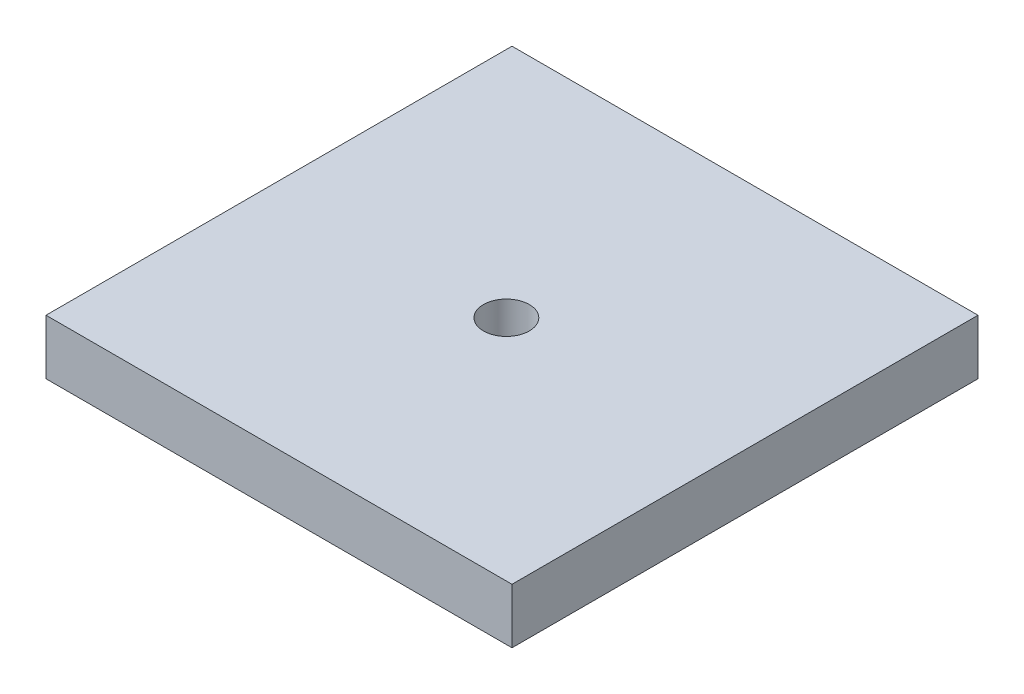
ISO-10303-21;
HEADER;
FILE_DESCRIPTION(('STEP AP214'),'2;1');
FILE_NAME('part.step','',(''),(''),'','','');
FILE_SCHEMA(('AUTOMOTIVE_DESIGN { 1 0 10303 214 1 1 1 1 }'));
ENDSEC;
DATA;
#1=APPLICATION_CONTEXT('core data for automotive mechanical design processes');
#2=APPLICATION_PROTOCOL_DEFINITION('international standard','automotive_design',2000,#1);
#3=PRODUCT_CONTEXT('',#1,'mechanical');
#4=PRODUCT('Part','Part','',(#3));
#5=PRODUCT_RELATED_PRODUCT_CATEGORY('part','',(#4));
#6=PRODUCT_DEFINITION_FORMATION('','',#4);
#7=PRODUCT_DEFINITION_CONTEXT('part definition',#1,'design');
#8=PRODUCT_DEFINITION('design','',#6,#7);
#9=PRODUCT_DEFINITION_SHAPE('','',#8);
#10=(LENGTH_UNIT() NAMED_UNIT(*) SI_UNIT(.MILLI.,.METRE.));
#11=(NAMED_UNIT(*) PLANE_ANGLE_UNIT() SI_UNIT($,.RADIAN.));
#12=(NAMED_UNIT(*) SI_UNIT($,.STERADIAN.) SOLID_ANGLE_UNIT());
#13=UNCERTAINTY_MEASURE_WITH_UNIT(LENGTH_MEASURE(1.E-05),#10,'distance_accuracy_value','');
#14=(GEOMETRIC_REPRESENTATION_CONTEXT(3) GLOBAL_UNCERTAINTY_ASSIGNED_CONTEXT((#13)) GLOBAL_UNIT_ASSIGNED_CONTEXT((#10,
#11,#12)) REPRESENTATION_CONTEXT('',''));
#15=CARTESIAN_POINT('',(0.,0.,0.));
#16=DIRECTION('',(0.,0.,1.));
#17=DIRECTION('',(1.,0.,0.));
#18=AXIS2_PLACEMENT_3D('',#15,#16,#17);
#19=CARTESIAN_POINT('',(12.7,3.,-12.7));
#20=DIRECTION('',(-1.,0.,0.));
#21=DIRECTION('',(0.,0.,1.));
#22=AXIS2_PLACEMENT_3D('',#19,#20,#21);
#23=PLANE('',#22);
#24=DIRECTION('',(0.,0.,-1.));
#25=VECTOR('',#24,1.);
#26=CARTESIAN_POINT('',(12.7,0.,-12.7));
#27=LINE('',#26,#25);
#28=CARTESIAN_POINT('',(12.7,0.,12.7));
#29=VERTEX_POINT('',#28);
#30=CARTESIAN_POINT('',(12.7,0.,-12.7));
#31=VERTEX_POINT('',#30);
#32=EDGE_CURVE('E97',#29,#31,#27,.T.);
#33=ORIENTED_EDGE('',*,*,#32,.T.);
#34=DIRECTION('',(0.,-1.,0.));
#35=VECTOR('',#34,1.);
#36=CARTESIAN_POINT('',(12.7,3.,-12.7));
#37=LINE('',#36,#35);
#38=CARTESIAN_POINT('',(12.7,3.,-12.7));
#39=VERTEX_POINT('',#38);
#40=EDGE_CURVE('E11',#39,#31,#37,.T.);
#41=ORIENTED_EDGE('',*,*,#40,.F.);
#42=DIRECTION('',(0.,0.,-1.));
#43=VECTOR('',#42,1.);
#44=CARTESIAN_POINT('',(12.7,3.,-12.7));
#45=LINE('',#44,#43);
#46=CARTESIAN_POINT('',(12.7,3.,12.7));
#47=VERTEX_POINT('',#46);
#48=EDGE_CURVE('E85',#47,#39,#45,.T.);
#49=ORIENTED_EDGE('',*,*,#48,.F.);
#50=DIRECTION('',(0.,-1.,0.));
#51=VECTOR('',#50,1.);
#52=CARTESIAN_POINT('',(12.7,3.,12.7));
#53=LINE('',#52,#51);
#54=EDGE_CURVE('E93',#47,#29,#53,.T.);
#55=ORIENTED_EDGE('',*,*,#54,.T.);
#56=EDGE_LOOP('',(#33,#41,#49,#55));
#57=FACE_BOUND('',#56,.T.);
#58=ADVANCED_FACE('F34',(#57),#23,.F.);
#59=CARTESIAN_POINT('',(-12.7,3.,-12.7));
#60=DIRECTION('',(0.,0.,1.));
#61=DIRECTION('',(1.,0.,0.));
#62=AXIS2_PLACEMENT_3D('',#59,#60,#61);
#63=PLANE('',#62);
#64=DIRECTION('',(-1.,0.,0.));
#65=VECTOR('',#64,1.);
#66=CARTESIAN_POINT('',(-12.7,0.,-12.7));
#67=LINE('',#66,#65);
#68=CARTESIAN_POINT('',(-12.7,0.,-12.7));
#69=VERTEX_POINT('',#68);
#70=EDGE_CURVE('E89',#31,#69,#67,.T.);
#71=ORIENTED_EDGE('',*,*,#70,.T.);
#72=DIRECTION('',(0.,-1.,0.));
#73=VECTOR('',#72,1.);
#74=CARTESIAN_POINT('',(-12.7,3.,-12.7));
#75=LINE('',#74,#73);
#76=CARTESIAN_POINT('',(-12.7,3.,-12.7));
#77=VERTEX_POINT('',#76);
#78=EDGE_CURVE('E42',#77,#69,#75,.T.);
#79=ORIENTED_EDGE('',*,*,#78,.F.);
#80=DIRECTION('',(-1.,0.,0.));
#81=VECTOR('',#80,1.);
#82=CARTESIAN_POINT('',(-12.7,3.,-12.7));
#83=LINE('',#82,#81);
#84=EDGE_CURVE('E80',#39,#77,#83,.T.);
#85=ORIENTED_EDGE('',*,*,#84,.F.);
#86=ORIENTED_EDGE('',*,*,#40,.T.);
#87=EDGE_LOOP('',(#71,#79,#85,#86));
#88=FACE_BOUND('',#87,.T.);
#89=ADVANCED_FACE('F88',(#88),#63,.F.);
#90=CARTESIAN_POINT('',(-12.7,3.,-12.7));
#91=DIRECTION('',(1.,0.,0.));
#92=DIRECTION('',(0.,0.,-1.));
#93=AXIS2_PLACEMENT_3D('',#90,#91,#92);
#94=PLANE('',#93);
#95=DIRECTION('',(0.,0.,1.));
#96=VECTOR('',#95,1.);
#97=CARTESIAN_POINT('',(-12.7,0.,-12.7));
#98=LINE('',#97,#96);
#99=CARTESIAN_POINT('',(-12.7,0.,12.7));
#100=VERTEX_POINT('',#99);
#101=EDGE_CURVE('E67',#69,#100,#98,.T.);
#102=ORIENTED_EDGE('',*,*,#101,.T.);
#103=DIRECTION('',(0.,-1.,0.));
#104=VECTOR('',#103,1.);
#105=CARTESIAN_POINT('',(-12.7,3.,12.7));
#106=LINE('',#105,#104);
#107=CARTESIAN_POINT('',(-12.7,3.,12.7));
#108=VERTEX_POINT('',#107);
#109=EDGE_CURVE('E90',#108,#100,#106,.T.);
#110=ORIENTED_EDGE('',*,*,#109,.F.);
#111=DIRECTION('',(0.,0.,1.));
#112=VECTOR('',#111,1.);
#113=CARTESIAN_POINT('',(-12.7,3.,-12.7));
#114=LINE('',#113,#112);
#115=EDGE_CURVE('E83',#77,#108,#114,.T.);
#116=ORIENTED_EDGE('',*,*,#115,.F.);
#117=ORIENTED_EDGE('',*,*,#78,.T.);
#118=EDGE_LOOP('',(#102,#110,#116,#117));
#119=FACE_BOUND('',#118,.T.);
#120=ADVANCED_FACE('F91',(#119),#94,.F.);
#121=CARTESIAN_POINT('',(-12.7,3.,12.7));
#122=DIRECTION('',(0.,0.,-1.));
#123=DIRECTION('',(-1.,0.,0.));
#124=AXIS2_PLACEMENT_3D('',#121,#122,#123);
#125=PLANE('',#124);
#126=DIRECTION('',(1.,0.,0.));
#127=VECTOR('',#126,1.);
#128=CARTESIAN_POINT('',(-12.7,0.,12.7));
#129=LINE('',#128,#127);
#130=EDGE_CURVE('E73',#100,#29,#129,.T.);
#131=ORIENTED_EDGE('',*,*,#130,.T.);
#132=ORIENTED_EDGE('',*,*,#54,.F.);
#133=DIRECTION('',(1.,0.,0.));
#134=VECTOR('',#133,1.);
#135=CARTESIAN_POINT('',(-12.7,3.,12.7));
#136=LINE('',#135,#134);
#137=EDGE_CURVE('E50',#108,#47,#136,.T.);
#138=ORIENTED_EDGE('',*,*,#137,.F.);
#139=ORIENTED_EDGE('',*,*,#109,.T.);
#140=EDGE_LOOP('',(#131,#132,#138,#139));
#141=FACE_BOUND('',#140,.T.);
#142=ADVANCED_FACE('F105',(#141),#125,.F.);
#143=CARTESIAN_POINT('',(0.,3.,0.));
#144=DIRECTION('',(0.,1.,0.));
#145=DIRECTION('',(0.,0.,1.));
#146=AXIS2_PLACEMENT_3D('',#143,#144,#145);
#147=PLANE('',#146);
#148=CARTESIAN_POINT('',(-0.033999566236953,3.,0.271996529895759));
#149=DIRECTION('',(0.,1.,0.));
#150=DIRECTION('',(0.,0.,1.));
#151=AXIS2_PLACEMENT_3D('',#148,#149,#150);
#152=CIRCLE('',#151,1.24999999999999);
#153=CARTESIAN_POINT('',(-0.033999566236953,3.,1.52199652989575));
#154=VERTEX_POINT('',#153);
#155=EDGE_CURVE('E113',#154,#154,#152,.T.);
#156=ORIENTED_EDGE('',*,*,#155,.F.);
#157=EDGE_LOOP('',(#156));
#158=FACE_BOUND('',#157,.T.);
#159=ORIENTED_EDGE('',*,*,#48,.T.);
#160=ORIENTED_EDGE('',*,*,#84,.T.);
#161=ORIENTED_EDGE('',*,*,#115,.T.);
#162=ORIENTED_EDGE('',*,*,#137,.T.);
#163=EDGE_LOOP('',(#159,#160,#161,#162));
#164=FACE_BOUND('',#163,.T.);
#165=ADVANCED_FACE('F81',(#158,#164),#147,.T.);
#166=CARTESIAN_POINT('',(0.,0.,0.));
#167=DIRECTION('',(0.,1.,0.));
#168=DIRECTION('',(0.,0.,1.));
#169=AXIS2_PLACEMENT_3D('',#166,#167,#168);
#170=PLANE('',#169);
#171=CARTESIAN_POINT('',(-0.033999566236953,0.,0.271996529895759));
#172=DIRECTION('',(0.,1.,0.));
#173=DIRECTION('',(0.,0.,1.));
#174=AXIS2_PLACEMENT_3D('',#171,#172,#173);
#175=CIRCLE('',#174,1.25);
#176=CARTESIAN_POINT('',(-0.033999566236953,0.,1.52199652989576));
#177=VERTEX_POINT('',#176);
#178=EDGE_CURVE('E100',#177,#177,#175,.T.);
#179=ORIENTED_EDGE('',*,*,#178,.T.);
#180=EDGE_LOOP('',(#179));
#181=FACE_BOUND('',#180,.T.);
#182=ORIENTED_EDGE('',*,*,#32,.F.);
#183=ORIENTED_EDGE('',*,*,#130,.F.);
#184=ORIENTED_EDGE('',*,*,#101,.F.);
#185=ORIENTED_EDGE('',*,*,#70,.F.);
#186=EDGE_LOOP('',(#182,#183,#184,#185));
#187=FACE_BOUND('',#186,.T.);
#188=ADVANCED_FACE('F108',(#181,#187),#170,.F.);
#189=CARTESIAN_POINT('',(-0.033999566236953,3.,0.271996529895759));
#190=DIRECTION('',(0.,1.,0.));
#191=DIRECTION('',(0.,0.,1.));
#192=AXIS2_PLACEMENT_3D('',#189,#190,#191);
#193=CYLINDRICAL_SURFACE('',#192,1.24999999999999);
#194=ORIENTED_EDGE('',*,*,#178,.F.);
#195=EDGE_LOOP('',(#194));
#196=FACE_BOUND('',#195,.T.);
#197=ORIENTED_EDGE('',*,*,#155,.T.);
#198=EDGE_LOOP('',(#197));
#199=FACE_BOUND('',#198,.T.);
#200=ADVANCED_FACE('F117',(#196,#199),#193,.F.);
#201=CLOSED_SHELL('',(#58,#89,#120,#142,#165,#188,#200));
#202=MANIFOLD_SOLID_BREP('B2',#201);
#203=ADVANCED_BREP_SHAPE_REPRESENTATION('',(#18,#202),#14);
#204=SHAPE_DEFINITION_REPRESENTATION(#9,#203);
ENDSEC;
END-ISO-10303-21;
